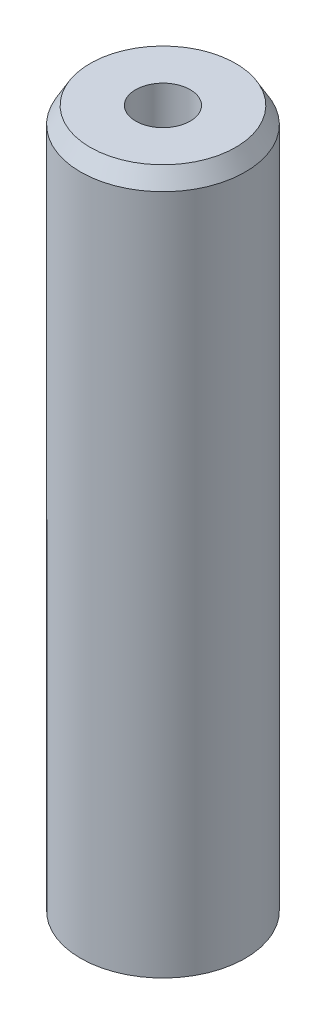
ISO-10303-21;
HEADER;
FILE_DESCRIPTION(('STEP AP214'),'2;1');
FILE_NAME('part.step','',(''),(''),'','','');
FILE_SCHEMA(('AUTOMOTIVE_DESIGN { 1 0 10303 214 1 1 1 1 }'));
ENDSEC;
DATA;
#1=APPLICATION_CONTEXT('core data for automotive mechanical design processes');
#2=APPLICATION_PROTOCOL_DEFINITION('international standard','automotive_design',2000,#1);
#3=PRODUCT_CONTEXT('',#1,'mechanical');
#4=PRODUCT('Part','Part','',(#3));
#5=PRODUCT_RELATED_PRODUCT_CATEGORY('part','',(#4));
#6=PRODUCT_DEFINITION_FORMATION('','',#4);
#7=PRODUCT_DEFINITION_CONTEXT('part definition',#1,'design');
#8=PRODUCT_DEFINITION('design','',#6,#7);
#9=PRODUCT_DEFINITION_SHAPE('','',#8);
#10=(LENGTH_UNIT() NAMED_UNIT(*) SI_UNIT(.MILLI.,.METRE.));
#11=(NAMED_UNIT(*) PLANE_ANGLE_UNIT() SI_UNIT($,.RADIAN.));
#12=(NAMED_UNIT(*) SI_UNIT($,.STERADIAN.) SOLID_ANGLE_UNIT());
#13=UNCERTAINTY_MEASURE_WITH_UNIT(LENGTH_MEASURE(1.E-05),#10,'distance_accuracy_value','');
#14=(GEOMETRIC_REPRESENTATION_CONTEXT(3) GLOBAL_UNCERTAINTY_ASSIGNED_CONTEXT((#13)) GLOBAL_UNIT_ASSIGNED_CONTEXT((#10,
#11,#12)) REPRESENTATION_CONTEXT('',''));
#15=CARTESIAN_POINT('',(0.,0.,0.));
#16=DIRECTION('',(0.,0.,1.));
#17=DIRECTION('',(1.,0.,0.));
#18=AXIS2_PLACEMENT_3D('',#15,#16,#17);
#19=CARTESIAN_POINT('',(0.,128.851055355184,0.));
#20=DIRECTION('',(0.,-1.,0.));
#21=DIRECTION('',(0.,0.,-1.));
#22=AXIS2_PLACEMENT_3D('',#19,#20,#21);
#23=CYLINDRICAL_SURFACE('',#22,15.);
#24=CARTESIAN_POINT('',(0.,125.829865972465,0.));
#25=DIRECTION('',(0.,1.,0.));
#26=DIRECTION('',(0.,0.,1.));
#27=AXIS2_PLACEMENT_3D('',#24,#25,#26);
#28=CIRCLE('',#27,15.);
#29=CARTESIAN_POINT('',(0.,125.829865972465,15.));
#30=VERTEX_POINT('',#29);
#31=EDGE_CURVE('E50',#30,#30,#28,.F.);
#32=ORIENTED_EDGE('',*,*,#31,.T.);
#33=EDGE_LOOP('',(#32));
#34=FACE_BOUND('',#33,.T.);
#35=CARTESIAN_POINT('',(0.,1.74428450338601,0.));
#36=DIRECTION('',(0.,1.,0.));
#37=DIRECTION('',(0.,0.,1.));
#38=AXIS2_PLACEMENT_3D('',#35,#36,#37);
#39=CIRCLE('',#38,15.);
#40=CARTESIAN_POINT('',(0.,1.74428450338601,15.));
#41=VERTEX_POINT('',#40);
#42=EDGE_CURVE('E51',#41,#41,#39,.T.);
#43=ORIENTED_EDGE('',*,*,#42,.T.);
#44=EDGE_LOOP('',(#43));
#45=FACE_BOUND('',#44,.T.);
#46=ADVANCED_FACE('F39',(#34,#45),#23,.T.);
#47=CARTESIAN_POINT('',(0.,128.851055355184,0.));
#48=DIRECTION('',(0.,1.,0.));
#49=DIRECTION('',(0.,0.,1.));
#50=AXIS2_PLACEMENT_3D('',#47,#48,#49);
#51=PLANE('',#50);
#52=CARTESIAN_POINT('',(0.,128.851055355184,0.));
#53=DIRECTION('',(0.,1.,0.));
#54=DIRECTION('',(0.,0.,1.));
#55=AXIS2_PLACEMENT_3D('',#52,#53,#54);
#56=CIRCLE('',#55,13.255715496614);
#57=CARTESIAN_POINT('',(0.,128.851055355184,13.255715496614));
#58=VERTEX_POINT('',#57);
#59=EDGE_CURVE('E54',#58,#58,#56,.T.);
#60=ORIENTED_EDGE('',*,*,#59,.T.);
#61=EDGE_LOOP('',(#60));
#62=FACE_BOUND('',#61,.T.);
#63=CARTESIAN_POINT('',(0.,128.851055355184,0.));
#64=DIRECTION('',(0.,1.,0.));
#65=DIRECTION('',(0.,0.,1.));
#66=AXIS2_PLACEMENT_3D('',#63,#64,#65);
#67=CIRCLE('',#66,4.9732767842618);
#68=CARTESIAN_POINT('',(0.,128.851055355184,4.9732767842618));
#69=VERTEX_POINT('',#68);
#70=EDGE_CURVE('E58',#69,#69,#67,.T.);
#71=ORIENTED_EDGE('',*,*,#70,.F.);
#72=EDGE_LOOP('',(#71));
#73=FACE_BOUND('',#72,.T.);
#74=ADVANCED_FACE('F69',(#62,#73),#51,.T.);
#75=CARTESIAN_POINT('',(0.,0.,0.));
#76=DIRECTION('',(0.,1.,0.));
#77=DIRECTION('',(0.,0.,1.));
#78=AXIS2_PLACEMENT_3D('',#75,#76,#77);
#79=PLANE('',#78);
#80=CARTESIAN_POINT('',(0.,0.,0.));
#81=DIRECTION('',(0.,1.,0.));
#82=DIRECTION('',(0.,0.,1.));
#83=AXIS2_PLACEMENT_3D('',#80,#81,#82);
#84=CIRCLE('',#83,11.9788106172804);
#85=CARTESIAN_POINT('',(0.,0.,11.9788106172804));
#86=VERTEX_POINT('',#85);
#87=EDGE_CURVE('E10',#86,#86,#84,.F.);
#88=ORIENTED_EDGE('',*,*,#87,.T.);
#89=EDGE_LOOP('',(#88));
#90=FACE_BOUND('',#89,.T.);
#91=CARTESIAN_POINT('',(0.,0.,0.));
#92=DIRECTION('',(0.,1.,0.));
#93=DIRECTION('',(0.,0.,1.));
#94=AXIS2_PLACEMENT_3D('',#91,#92,#93);
#95=CIRCLE('',#94,4.9732767842618);
#96=CARTESIAN_POINT('',(0.,0.,4.9732767842618));
#97=VERTEX_POINT('',#96);
#98=EDGE_CURVE('E63',#97,#97,#95,.T.);
#99=ORIENTED_EDGE('',*,*,#98,.T.);
#100=EDGE_LOOP('',(#99));
#101=FACE_BOUND('',#100,.T.);
#102=ADVANCED_FACE('F75',(#90,#101),#79,.F.);
#103=CARTESIAN_POINT('',(0.,128.851055355184,0.));
#104=DIRECTION('',(0.,-1.,0.));
#105=DIRECTION('',(0.,0.,-1.));
#106=AXIS2_PLACEMENT_3D('',#103,#104,#105);
#107=CYLINDRICAL_SURFACE('',#106,4.9732767842618);
#108=ORIENTED_EDGE('',*,*,#70,.T.);
#109=EDGE_LOOP('',(#108));
#110=FACE_BOUND('',#109,.T.);
#111=ORIENTED_EDGE('',*,*,#98,.F.);
#112=EDGE_LOOP('',(#111));
#113=FACE_BOUND('',#112,.T.);
#114=ADVANCED_FACE('F70',(#110,#113),#107,.F.);
#115=CARTESIAN_POINT('',(0.,128.851055355184,0.));
#116=DIRECTION('',(0.,-1.,0.));
#117=DIRECTION('',(0.,0.,-1.));
#118=AXIS2_PLACEMENT_3D('',#115,#116,#117);
#119=CONICAL_SURFACE('',#118,13.255715496614,0.523598775598296);
#120=ORIENTED_EDGE('',*,*,#31,.F.);
#121=EDGE_LOOP('',(#120));
#122=FACE_BOUND('',#121,.T.);
#123=ORIENTED_EDGE('',*,*,#59,.F.);
#124=EDGE_LOOP('',(#123));
#125=FACE_BOUND('',#124,.T.);
#126=ADVANCED_FACE('F81',(#122,#125),#119,.T.);
#127=CARTESIAN_POINT('',(0.,1.74428450338601,0.));
#128=DIRECTION('',(0.,1.,0.));
#129=DIRECTION('',(0.,0.,1.));
#130=AXIS2_PLACEMENT_3D('',#127,#128,#129);
#131=CONICAL_SURFACE('',#130,15.,1.0471975511966);
#132=CARTESIAN_POINT('',(0.,0.,11.9788106172804));
#133=CARTESIAN_POINT('',(0.,0.0181696302436039,12.010281340017));
#134=CARTESIAN_POINT('',(0.,0.0363392604872083,12.0417520627537));
#135=CARTESIAN_POINT('',(0.,0.072678520974417,12.104693508227));
#136=CARTESIAN_POINT('',(0.,0.0908481512180214,12.1361642309637));
#137=CARTESIAN_POINT('',(0.,0.12718741170523,12.199105676437));
#138=CARTESIAN_POINT('',(0.,0.145357041948834,12.2305763991737));
#139=CARTESIAN_POINT('',(0.,0.181696302436043,12.293517844647));
#140=CARTESIAN_POINT('',(0.,0.199865932679647,12.3249885673837));
#141=CARTESIAN_POINT('',(0.,0.236205193166855,12.387930012857));
#142=CARTESIAN_POINT('',(0.,0.25437482341046,12.4194007355936));
#143=CARTESIAN_POINT('',(0.,0.290714083897669,12.482342181067));
#144=CARTESIAN_POINT('',(0.,0.308883714141273,12.5138129038036));
#145=CARTESIAN_POINT('',(0.,0.345222974628482,12.576754349277));
#146=CARTESIAN_POINT('',(0.,0.363392604872086,12.6082250720136));
#147=CARTESIAN_POINT('',(0.,0.399731865359294,12.6711665174869));
#148=CARTESIAN_POINT('',(0.,0.417901495602898,12.7026372402236));
#149=CARTESIAN_POINT('',(0.,0.454240756090107,12.7655786856969));
#150=CARTESIAN_POINT('',(0.,0.472410386333711,12.7970494084336));
#151=CARTESIAN_POINT('',(0.,0.50874964682092,12.8599908539069));
#152=CARTESIAN_POINT('',(0.,0.526919277064524,12.8914615766436));
#153=CARTESIAN_POINT('',(0.,0.563258537551733,12.9544030221169));
#154=CARTESIAN_POINT('',(0.,0.581428167795337,12.9858737448536));
#155=CARTESIAN_POINT('',(0.,0.617767428282546,13.0488151903269));
#156=CARTESIAN_POINT('',(0.,0.63593705852615,13.0802859130636));
#157=CARTESIAN_POINT('',(0.,0.672276319013359,13.1432273585369));
#158=CARTESIAN_POINT('',(0.,0.690445949256963,13.1746980812735));
#159=CARTESIAN_POINT('',(0.,0.726785209744172,13.2376395267469));
#160=CARTESIAN_POINT('',(0.,0.744954839987776,13.2691102494835));
#161=CARTESIAN_POINT('',(0.,0.781294100474984,13.3320516949569));
#162=CARTESIAN_POINT('',(0.,0.799463730718589,13.3635224176935));
#163=CARTESIAN_POINT('',(0.,0.835802991205797,13.4264638631669));
#164=CARTESIAN_POINT('',(0.,0.853972621449401,13.4579345859035));
#165=CARTESIAN_POINT('',(0.,0.89031188193661,13.5208760313768));
#166=CARTESIAN_POINT('',(0.,0.908481512180215,13.5523467541135));
#167=CARTESIAN_POINT('',(0.,0.944820772667423,13.6152881995868));
#168=CARTESIAN_POINT('',(0.,0.962990402911027,13.6467589223235));
#169=CARTESIAN_POINT('',(0.,0.999329663398236,13.7097003677968));
#170=CARTESIAN_POINT('',(0.,1.01749929364184,13.7411710905335));
#171=CARTESIAN_POINT('',(0.,1.05383855412905,13.8041125360068));
#172=CARTESIAN_POINT('',(0.,1.07200818437265,13.8355832587435));
#173=CARTESIAN_POINT('',(0.,1.10834744485986,13.8985247042168));
#174=CARTESIAN_POINT('',(0.,1.12651707510347,13.9299954269535));
#175=CARTESIAN_POINT('',(0.,1.16285633559067,13.9929368724268));
#176=CARTESIAN_POINT('',(0.,1.18102596583428,14.0244075951634));
#177=CARTESIAN_POINT('',(0.,1.21736522632149,14.0873490406368));
#178=CARTESIAN_POINT('',(0.,1.23553485656509,14.1188197633734));
#179=CARTESIAN_POINT('',(0.,1.2718741170523,14.1817612088468));
#180=CARTESIAN_POINT('',(0.,1.2900437472959,14.2132319315834));
#181=CARTESIAN_POINT('',(0.,1.32638300778311,14.2761733770568));
#182=CARTESIAN_POINT('',(0.,1.34455263802672,14.3076440997934));
#183=CARTESIAN_POINT('',(0.,1.38089189851393,14.3705855452667));
#184=CARTESIAN_POINT('',(0.,1.39906152875753,14.4020562680034));
#185=CARTESIAN_POINT('',(0.,1.43540078924474,14.4649977134767));
#186=CARTESIAN_POINT('',(0.,1.45357041948834,14.4964684362134));
#187=CARTESIAN_POINT('',(0.,1.48990967997555,14.5594098816867));
#188=CARTESIAN_POINT('',(0.,1.50807931021916,14.5908806044234));
#189=CARTESIAN_POINT('',(0.,1.54441857070636,14.6538220498967));
#190=CARTESIAN_POINT('',(0.,1.56258820094997,14.6852927726334));
#191=CARTESIAN_POINT('',(0.,1.59892746143718,14.7482342181067));
#192=CARTESIAN_POINT('',(0.,1.61709709168078,14.7797049408434));
#193=CARTESIAN_POINT('',(0.,1.65343635216799,14.8426463863167));
#194=CARTESIAN_POINT('',(0.,1.67160598241159,14.8741171090533));
#195=CARTESIAN_POINT('',(0.,1.7079452428988,14.9370585545267));
#196=CARTESIAN_POINT('',(0.,1.72611487314241,14.9685292772633));
#197=CARTESIAN_POINT('',(0.,1.74428450338601,15.));
#198=B_SPLINE_CURVE_WITH_KNOTS('',3,(#132,#133,#134,#135,#136,#137,#138,#139,#140,#141,#142,
#143,#144,#145,#146,#147,#148,#149,#150,#151,#152,#153,#154,#155,#156,#157,#158,#159,#160,#161,
#162,#163,#164,#165,#166,#167,#168,#169,#170,#171,#172,#173,#174,#175,#176,#177,#178,#179,#180,
#181,#182,#183,#184,#185,#186,#187,#188,#189,#190,#191,#192,#193,#194,#195,#196,#197),
.UNSPECIFIED.,.F.,.F.,(4,2,2,2,2,2,2,2,2,2,2,2,2,2,2,2,2,2,2,2,2,2,2,2,2,2,2,2,2,2,2,2,4),(0.,
0.109017781461626,0.218035562923251,0.327053344384878,0.436071125846505,0.545088907308131,
0.654106688769756,0.763124470231383,0.872142251693011,0.981160033154636,1.09017781461626,
1.19919559607789,1.30821337753952,1.41723115900114,1.52624894046277,1.63526672192439,
1.74428450338602,1.85330228484765,1.96232006630927,2.0713378477709,2.18035562923253,
2.28937341069415,2.39839119215578,2.50740897361741,2.61642675507903,2.72544453654066,
2.83446231800228,2.94348009946391,3.05249788092554,3.16151566238716,3.27053344384879,
3.37955122531042,3.48856900677204),.UNSPECIFIED.);
#199=EDGE_CURVE('BSEAM45',#86,#41,#198,.T.);
#200=ORIENTED_EDGE('',*,*,#87,.F.);
#201=ORIENTED_EDGE('',*,*,#42,.F.);
#202=ORIENTED_EDGE('',*,*,#199,.T.);
#203=ORIENTED_EDGE('',*,*,#199,.F.);
#204=EDGE_LOOP('',(#200,#202,#201,#203));
#205=FACE_BOUND('',#204,.T.);
#206=ADVANCED_FACE('F45',(#205),#131,.T.);
#207=CLOSED_SHELL('',(#46,#74,#102,#114,#126,#206));
#208=MANIFOLD_SOLID_BREP('B2',#207);
#209=ADVANCED_BREP_SHAPE_REPRESENTATION('',(#18,#208),#14);
#210=SHAPE_DEFINITION_REPRESENTATION(#9,#209);
ENDSEC;
END-ISO-10303-21;
